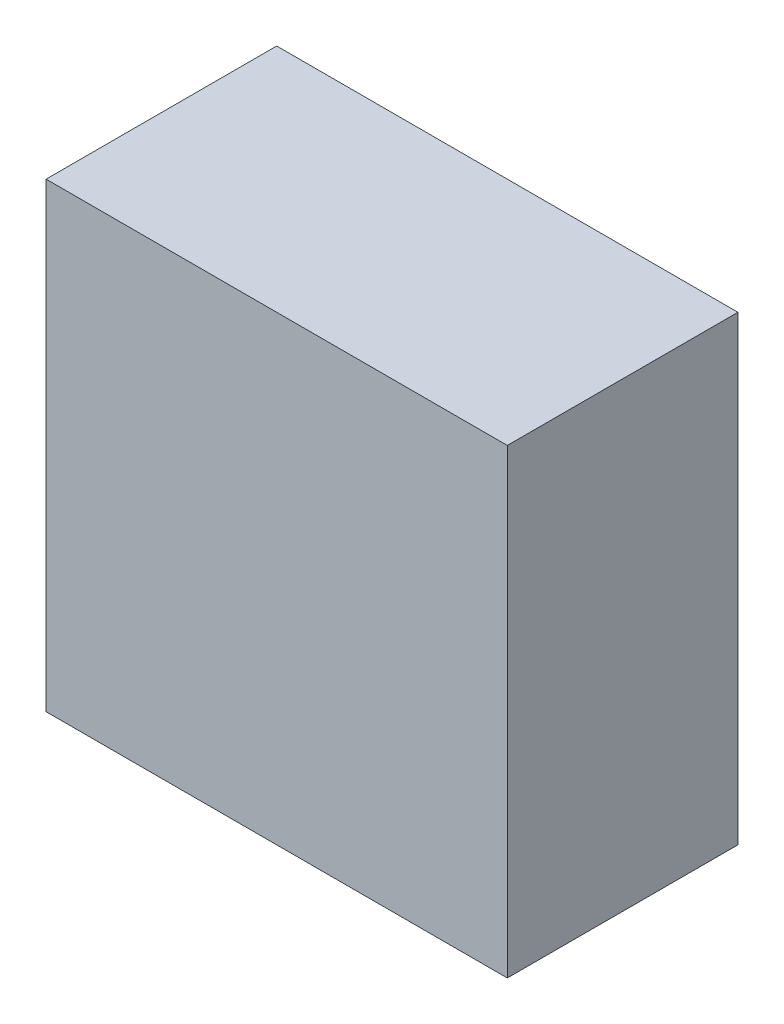
ISO-10303-21;
HEADER;
FILE_DESCRIPTION(('STEP AP214'),'2;1');
FILE_NAME('part.step','',(''),(''),'','','');
FILE_SCHEMA(('AUTOMOTIVE_DESIGN { 1 0 10303 214 1 1 1 1 }'));
ENDSEC;
DATA;
#1=APPLICATION_CONTEXT('core data for automotive mechanical design processes');
#2=APPLICATION_PROTOCOL_DEFINITION('international standard','automotive_design',2000,#1);
#3=PRODUCT_CONTEXT('',#1,'mechanical');
#4=PRODUCT('Part','Part','',(#3));
#5=PRODUCT_RELATED_PRODUCT_CATEGORY('part','',(#4));
#6=PRODUCT_DEFINITION_FORMATION('','',#4);
#7=PRODUCT_DEFINITION_CONTEXT('part definition',#1,'design');
#8=PRODUCT_DEFINITION('design','',#6,#7);
#9=PRODUCT_DEFINITION_SHAPE('','',#8);
#10=(LENGTH_UNIT() NAMED_UNIT(*) SI_UNIT(.MILLI.,.METRE.));
#11=(NAMED_UNIT(*) PLANE_ANGLE_UNIT() SI_UNIT($,.RADIAN.));
#12=(NAMED_UNIT(*) SI_UNIT($,.STERADIAN.) SOLID_ANGLE_UNIT());
#13=UNCERTAINTY_MEASURE_WITH_UNIT(LENGTH_MEASURE(1.E-05),#10,'distance_accuracy_value','');
#14=(GEOMETRIC_REPRESENTATION_CONTEXT(3) GLOBAL_UNCERTAINTY_ASSIGNED_CONTEXT((#13)) GLOBAL_UNIT_ASSIGNED_CONTEXT((#10,
#11,#12)) REPRESENTATION_CONTEXT('',''));
#15=CARTESIAN_POINT('',(0.,0.,0.));
#16=DIRECTION('',(0.,0.,1.));
#17=DIRECTION('',(1.,0.,0.));
#18=AXIS2_PLACEMENT_3D('',#15,#16,#17);
#19=CARTESIAN_POINT('',(0.,0.,2.75));
#20=DIRECTION('',(0.,0.,-1.));
#21=DIRECTION('',(-1.,0.,0.));
#22=AXIS2_PLACEMENT_3D('',#19,#20,#21);
#23=PLANE('',#22);
#24=DIRECTION('',(1.,0.,0.));
#25=VECTOR('',#24,1.);
#26=CARTESIAN_POINT('',(102.,165.941489418563,2.75));
#27=LINE('',#26,#25);
#28=CARTESIAN_POINT('',(98.,165.941489418563,2.75));
#29=VERTEX_POINT('',#28);
#30=CARTESIAN_POINT('',(102.,165.941489418563,2.75));
#31=VERTEX_POINT('',#30);
#32=EDGE_CURVE('E80',#29,#31,#27,.T.);
#33=ORIENTED_EDGE('',*,*,#32,.T.);
#34=DIRECTION('',(0.,1.,0.));
#35=VECTOR('',#34,1.);
#36=CARTESIAN_POINT('',(102.,169.941489418563,2.75));
#37=LINE('',#36,#35);
#38=CARTESIAN_POINT('',(102.,169.941489418563,2.75));
#39=VERTEX_POINT('',#38);
#40=EDGE_CURVE('E55',#31,#39,#37,.T.);
#41=ORIENTED_EDGE('',*,*,#40,.T.);
#42=DIRECTION('',(1.,0.,0.));
#43=VECTOR('',#42,1.);
#44=CARTESIAN_POINT('',(102.,169.941489418563,2.75));
#45=LINE('',#44,#43);
#46=CARTESIAN_POINT('',(98.,169.941489418563,2.75));
#47=VERTEX_POINT('',#46);
#48=EDGE_CURVE('E57',#39,#47,#45,.F.);
#49=ORIENTED_EDGE('',*,*,#48,.T.);
#50=DIRECTION('',(0.,1.,0.));
#51=VECTOR('',#50,1.);
#52=CARTESIAN_POINT('',(98.,169.941489418563,2.75));
#53=LINE('',#52,#51);
#54=EDGE_CURVE('E20',#47,#29,#53,.F.);
#55=ORIENTED_EDGE('',*,*,#54,.T.);
#56=EDGE_LOOP('',(#33,#41,#49,#55));
#57=FACE_BOUND('',#56,.T.);
#58=ADVANCED_FACE('F17',(#57),#23,.F.);
#59=CARTESIAN_POINT('',(98.,169.941489418563,2.75));
#60=DIRECTION('',(1.,0.,0.));
#61=DIRECTION('',(0.,0.,-1.));
#62=AXIS2_PLACEMENT_3D('',#59,#60,#61);
#63=PLANE('',#62);
#64=DIRECTION('',(0.,0.,1.));
#65=VECTOR('',#64,1.);
#66=CARTESIAN_POINT('',(98.,165.941489418563,2.75));
#67=LINE('',#66,#65);
#68=CARTESIAN_POINT('',(98.,165.941489418563,0.75));
#69=VERTEX_POINT('',#68);
#70=EDGE_CURVE('E68',#69,#29,#67,.T.);
#71=ORIENTED_EDGE('',*,*,#70,.T.);
#72=ORIENTED_EDGE('',*,*,#54,.F.);
#73=DIRECTION('',(0.,0.,-1.));
#74=VECTOR('',#73,1.);
#75=CARTESIAN_POINT('',(98.,169.941489418563,2.75));
#76=LINE('',#75,#74);
#77=CARTESIAN_POINT('',(98.,169.941489418563,0.75));
#78=VERTEX_POINT('',#77);
#79=EDGE_CURVE('E63',#47,#78,#76,.T.);
#80=ORIENTED_EDGE('',*,*,#79,.T.);
#81=DIRECTION('',(0.,1.,0.));
#82=VECTOR('',#81,1.);
#83=CARTESIAN_POINT('',(98.,0.,0.75));
#84=LINE('',#83,#82);
#85=EDGE_CURVE('E83',#69,#78,#84,.T.);
#86=ORIENTED_EDGE('',*,*,#85,.F.);
#87=EDGE_LOOP('',(#71,#72,#80,#86));
#88=FACE_BOUND('',#87,.T.);
#89=ADVANCED_FACE('F65',(#88),#63,.F.);
#90=CARTESIAN_POINT('',(102.,169.941489418563,2.75));
#91=DIRECTION('',(0.,-1.,0.));
#92=DIRECTION('',(0.,0.,-1.));
#93=AXIS2_PLACEMENT_3D('',#90,#91,#92);
#94=PLANE('',#93);
#95=ORIENTED_EDGE('',*,*,#79,.F.);
#96=ORIENTED_EDGE('',*,*,#48,.F.);
#97=DIRECTION('',(0.,0.,1.));
#98=VECTOR('',#97,1.);
#99=CARTESIAN_POINT('',(102.,169.941489418563,2.75));
#100=LINE('',#99,#98);
#101=CARTESIAN_POINT('',(102.,169.941489418563,0.75));
#102=VERTEX_POINT('',#101);
#103=EDGE_CURVE('E75',#39,#102,#100,.F.);
#104=ORIENTED_EDGE('',*,*,#103,.T.);
#105=DIRECTION('',(-1.,0.,0.));
#106=VECTOR('',#105,1.);
#107=CARTESIAN_POINT('',(0.,169.941489418563,0.75));
#108=LINE('',#107,#106);
#109=EDGE_CURVE('E72',#78,#102,#108,.F.);
#110=ORIENTED_EDGE('',*,*,#109,.F.);
#111=EDGE_LOOP('',(#95,#96,#104,#110));
#112=FACE_BOUND('',#111,.T.);
#113=ADVANCED_FACE('F70',(#112),#94,.F.);
#114=CARTESIAN_POINT('',(102.,169.941489418563,2.75));
#115=DIRECTION('',(-1.,0.,0.));
#116=DIRECTION('',(0.,0.,1.));
#117=AXIS2_PLACEMENT_3D('',#114,#115,#116);
#118=PLANE('',#117);
#119=ORIENTED_EDGE('',*,*,#103,.F.);
#120=ORIENTED_EDGE('',*,*,#40,.F.);
#121=DIRECTION('',(0.,0.,1.));
#122=VECTOR('',#121,1.);
#123=CARTESIAN_POINT('',(102.,165.941489418563,2.75));
#124=LINE('',#123,#122);
#125=CARTESIAN_POINT('',(102.,165.941489418563,0.75));
#126=VERTEX_POINT('',#125);
#127=EDGE_CURVE('E35',#31,#126,#124,.F.);
#128=ORIENTED_EDGE('',*,*,#127,.T.);
#129=DIRECTION('',(0.,1.,0.));
#130=VECTOR('',#129,1.);
#131=CARTESIAN_POINT('',(102.,0.,0.75));
#132=LINE('',#131,#130);
#133=EDGE_CURVE('E26',#102,#126,#132,.F.);
#134=ORIENTED_EDGE('',*,*,#133,.F.);
#135=EDGE_LOOP('',(#119,#120,#128,#134));
#136=FACE_BOUND('',#135,.T.);
#137=ADVANCED_FACE('F89',(#136),#118,.F.);
#138=CARTESIAN_POINT('',(102.,165.941489418563,2.75));
#139=DIRECTION('',(0.,1.,0.));
#140=DIRECTION('',(0.,0.,1.));
#141=AXIS2_PLACEMENT_3D('',#138,#139,#140);
#142=PLANE('',#141);
#143=ORIENTED_EDGE('',*,*,#127,.F.);
#144=ORIENTED_EDGE('',*,*,#32,.F.);
#145=ORIENTED_EDGE('',*,*,#70,.F.);
#146=DIRECTION('',(-1.,0.,0.));
#147=VECTOR('',#146,1.);
#148=CARTESIAN_POINT('',(0.,165.941489418563,0.75));
#149=LINE('',#148,#147);
#150=EDGE_CURVE('E11',#126,#69,#149,.T.);
#151=ORIENTED_EDGE('',*,*,#150,.F.);
#152=EDGE_LOOP('',(#143,#144,#145,#151));
#153=FACE_BOUND('',#152,.T.);
#154=ADVANCED_FACE('F91',(#153),#142,.F.);
#155=CARTESIAN_POINT('',(0.,0.,0.75));
#156=DIRECTION('',(0.,0.,-1.));
#157=DIRECTION('',(-1.,0.,0.));
#158=AXIS2_PLACEMENT_3D('',#155,#156,#157);
#159=PLANE('',#158);
#160=ORIENTED_EDGE('',*,*,#133,.T.);
#161=ORIENTED_EDGE('',*,*,#150,.T.);
#162=ORIENTED_EDGE('',*,*,#85,.T.);
#163=ORIENTED_EDGE('',*,*,#109,.T.);
#164=EDGE_LOOP('',(#160,#161,#162,#163));
#165=FACE_BOUND('',#164,.T.);
#166=ADVANCED_FACE('F88',(#165),#159,.T.);
#167=CLOSED_SHELL('',(#58,#89,#113,#137,#154,#166));
#168=MANIFOLD_SOLID_BREP('B1',#167);
#169=ADVANCED_BREP_SHAPE_REPRESENTATION('',(#18,#168),#14);
#170=SHAPE_DEFINITION_REPRESENTATION(#9,#169);
ENDSEC;
END-ISO-10303-21;
